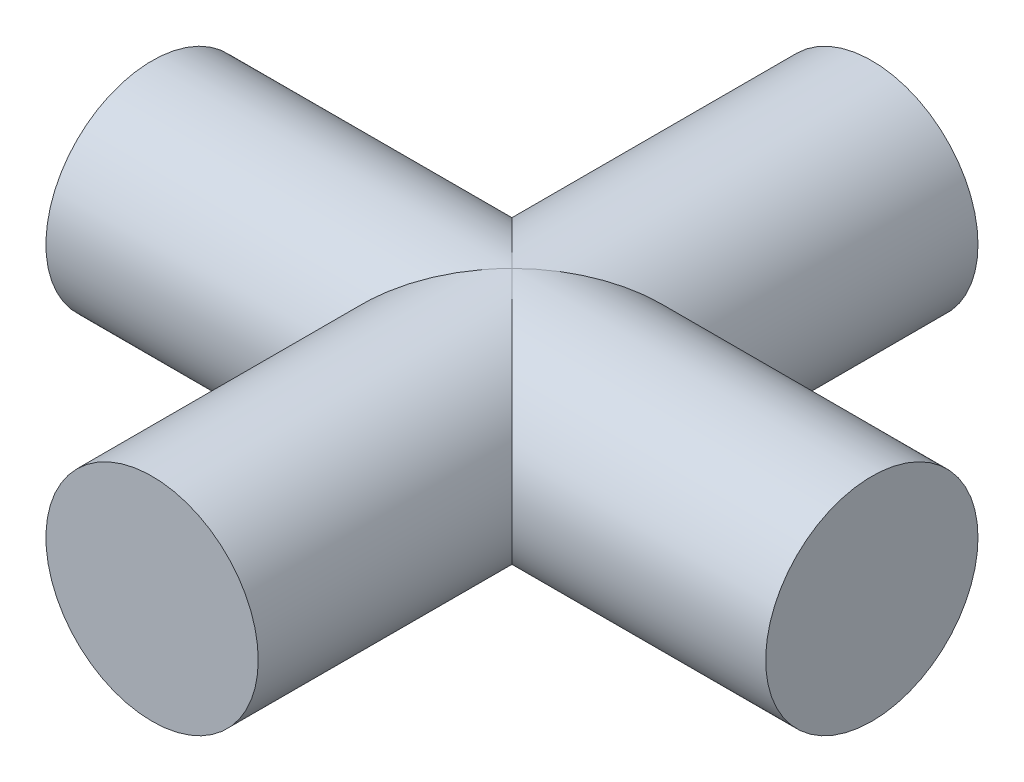
ISO-10303-21;
HEADER;
FILE_DESCRIPTION(('STEP AP214'),'2;1');
FILE_NAME('part.step','',(''),(''),'','','');
FILE_SCHEMA(('AUTOMOTIVE_DESIGN { 1 0 10303 214 1 1 1 1 }'));
ENDSEC;
DATA;
#1=APPLICATION_CONTEXT('core data for automotive mechanical design processes');
#2=APPLICATION_PROTOCOL_DEFINITION('international standard','automotive_design',2000,#1);
#3=PRODUCT_CONTEXT('',#1,'mechanical');
#4=PRODUCT('Part','Part','',(#3));
#5=PRODUCT_RELATED_PRODUCT_CATEGORY('part','',(#4));
#6=PRODUCT_DEFINITION_FORMATION('','',#4);
#7=PRODUCT_DEFINITION_CONTEXT('part definition',#1,'design');
#8=PRODUCT_DEFINITION('design','',#6,#7);
#9=PRODUCT_DEFINITION_SHAPE('','',#8);
#10=(LENGTH_UNIT() NAMED_UNIT(*) SI_UNIT(.MILLI.,.METRE.));
#11=(NAMED_UNIT(*) PLANE_ANGLE_UNIT() SI_UNIT($,.RADIAN.));
#12=(NAMED_UNIT(*) SI_UNIT($,.STERADIAN.) SOLID_ANGLE_UNIT());
#13=UNCERTAINTY_MEASURE_WITH_UNIT(LENGTH_MEASURE(1.E-05),#10,'distance_accuracy_value','');
#14=(GEOMETRIC_REPRESENTATION_CONTEXT(3) GLOBAL_UNCERTAINTY_ASSIGNED_CONTEXT((#13)) GLOBAL_UNIT_ASSIGNED_CONTEXT((#10,
#11,#12)) REPRESENTATION_CONTEXT('',''));
#15=CARTESIAN_POINT('',(0.,0.,0.));
#16=DIRECTION('',(0.,0.,1.));
#17=DIRECTION('',(1.,0.,0.));
#18=AXIS2_PLACEMENT_3D('',#15,#16,#17);
#19=CARTESIAN_POINT('',(0.,0.,5.));
#20=DIRECTION('',(0.,0.,-1.));
#21=DIRECTION('',(-1.,0.,0.));
#22=AXIS2_PLACEMENT_3D('',#19,#20,#21);
#23=CYLINDRICAL_SURFACE('',#22,1.475);
#24=CARTESIAN_POINT('',(0.,0.,5.));
#25=DIRECTION('',(0.,0.,1.));
#26=DIRECTION('',(1.,0.,0.));
#27=AXIS2_PLACEMENT_3D('',#24,#25,#26);
#28=CIRCLE('',#27,1.475);
#29=CARTESIAN_POINT('',(1.475,0.,5.));
#30=VERTEX_POINT('',#29);
#31=EDGE_CURVE('E70',#30,#30,#28,.T.);
#32=ORIENTED_EDGE('',*,*,#31,.F.);
#33=EDGE_LOOP('',(#32));
#34=FACE_BOUND('',#33,.T.);
#35=CARTESIAN_POINT('',(0.,0.,0.));
#36=DIRECTION('',(-0.707106781186547,0.,-0.707106781186547));
#37=DIRECTION('',(0.707106781186547,0.,-0.707106781186547));
#38=AXIS2_PLACEMENT_3D('',#35,#36,#37);
#39=ELLIPSE('',#38,2.08596500450032,1.475);
#40=CARTESIAN_POINT('',(0.,-1.475,0.));
#41=VERTEX_POINT('',#40);
#42=CARTESIAN_POINT('',(0.,1.475,0.));
#43=VERTEX_POINT('',#42);
#44=EDGE_CURVE('E52',#41,#43,#39,.T.);
#45=ORIENTED_EDGE('',*,*,#44,.F.);
#46=CARTESIAN_POINT('',(0.,0.,0.));
#47=DIRECTION('',(0.707106781186547,0.,-0.707106781186547));
#48=DIRECTION('',(-0.707106781186547,0.,-0.707106781186547));
#49=AXIS2_PLACEMENT_3D('',#46,#47,#48);
#50=ELLIPSE('',#49,2.08596500450032,1.475);
#51=EDGE_CURVE('E64',#43,#41,#50,.T.);
#52=ORIENTED_EDGE('',*,*,#51,.F.);
#53=EDGE_LOOP('',(#45,#52));
#54=FACE_BOUND('',#53,.T.);
#55=ADVANCED_FACE('F43',(#34,#54),#23,.T.);
#56=CARTESIAN_POINT('',(0.,0.,5.));
#57=DIRECTION('',(0.,0.,1.));
#58=DIRECTION('',(1.,0.,0.));
#59=AXIS2_PLACEMENT_3D('',#56,#57,#58);
#60=PLANE('',#59);
#61=ORIENTED_EDGE('',*,*,#31,.T.);
#62=EDGE_LOOP('',(#61));
#63=FACE_BOUND('',#62,.T.);
#64=ADVANCED_FACE('F94',(#63),#60,.T.);
#65=CARTESIAN_POINT('',(-5.,0.,0.));
#66=DIRECTION('',(1.,0.,0.));
#67=DIRECTION('',(0.,0.,-1.));
#68=AXIS2_PLACEMENT_3D('',#65,#66,#67);
#69=PLANE('',#68);
#70=CARTESIAN_POINT('',(-5.,0.,0.));
#71=DIRECTION('',(1.,0.,0.));
#72=DIRECTION('',(0.,0.,-1.));
#73=AXIS2_PLACEMENT_3D('',#70,#71,#72);
#74=CIRCLE('',#73,1.475);
#75=CARTESIAN_POINT('',(-5.,0.,-1.475));
#76=VERTEX_POINT('',#75);
#77=EDGE_CURVE('E111',#76,#76,#74,.T.);
#78=ORIENTED_EDGE('',*,*,#77,.F.);
#79=EDGE_LOOP('',(#78));
#80=FACE_BOUND('',#79,.T.);
#81=ADVANCED_FACE('F91',(#80),#69,.F.);
#82=CARTESIAN_POINT('',(5.,0.,0.));
#83=DIRECTION('',(-1.,0.,0.));
#84=DIRECTION('',(0.,0.,1.));
#85=AXIS2_PLACEMENT_3D('',#82,#83,#84);
#86=CYLINDRICAL_SURFACE('',#85,1.475);
#87=ORIENTED_EDGE('',*,*,#77,.T.);
#88=EDGE_LOOP('',(#87));
#89=FACE_BOUND('',#88,.T.);
#90=CARTESIAN_POINT('',(0.,0.,0.));
#91=DIRECTION('',(0.707106781186547,0.,-0.707106781186547));
#92=DIRECTION('',(-0.707106781186547,0.,-0.707106781186547));
#93=AXIS2_PLACEMENT_3D('',#90,#91,#92);
#94=ELLIPSE('',#93,2.08596500450032,1.475);
#95=EDGE_CURVE('E58',#43,#41,#94,.F.);
#96=ORIENTED_EDGE('',*,*,#95,.T.);
#97=ORIENTED_EDGE('',*,*,#44,.T.);
#98=EDGE_LOOP('',(#96,#97));
#99=FACE_BOUND('',#98,.T.);
#100=ADVANCED_FACE('F72',(#89,#99),#86,.T.);
#101=CARTESIAN_POINT('',(0.,0.,-5.));
#102=DIRECTION('',(0.,0.,1.));
#103=DIRECTION('',(1.,0.,0.));
#104=AXIS2_PLACEMENT_3D('',#101,#102,#103);
#105=PLANE('',#104);
#106=CARTESIAN_POINT('',(0.,0.,-5.));
#107=DIRECTION('',(0.,0.,1.));
#108=DIRECTION('',(1.,0.,0.));
#109=AXIS2_PLACEMENT_3D('',#106,#107,#108);
#110=CIRCLE('',#109,1.475);
#111=CARTESIAN_POINT('',(1.475,0.,-5.));
#112=VERTEX_POINT('',#111);
#113=EDGE_CURVE('E103',#112,#112,#110,.T.);
#114=ORIENTED_EDGE('',*,*,#113,.F.);
#115=EDGE_LOOP('',(#114));
#116=FACE_BOUND('',#115,.T.);
#117=ADVANCED_FACE('F85',(#116),#105,.F.);
#118=ORIENTED_EDGE('',*,*,#113,.T.);
#119=EDGE_LOOP('',(#118));
#120=FACE_BOUND('',#119,.T.);
#121=CARTESIAN_POINT('',(0.,0.,0.));
#122=DIRECTION('',(-0.707106781186547,0.,-0.707106781186547));
#123=DIRECTION('',(0.707106781186547,0.,-0.707106781186547));
#124=AXIS2_PLACEMENT_3D('',#121,#122,#123);
#125=ELLIPSE('',#124,2.08596500450032,1.475);
#126=EDGE_CURVE('E11',#41,#43,#125,.F.);
#127=ORIENTED_EDGE('',*,*,#126,.F.);
#128=ORIENTED_EDGE('',*,*,#95,.F.);
#129=EDGE_LOOP('',(#127,#128));
#130=FACE_BOUND('',#129,.T.);
#131=ADVANCED_FACE('F45',(#120,#130),#23,.T.);
#132=CARTESIAN_POINT('',(5.,0.,0.));
#133=DIRECTION('',(1.,0.,0.));
#134=DIRECTION('',(0.,0.,-1.));
#135=AXIS2_PLACEMENT_3D('',#132,#133,#134);
#136=CIRCLE('',#135,1.475);
#137=CARTESIAN_POINT('',(5.,0.,-1.475));
#138=VERTEX_POINT('',#137);
#139=EDGE_CURVE('E108',#138,#138,#136,.T.);
#140=ORIENTED_EDGE('',*,*,#139,.F.);
#141=EDGE_LOOP('',(#140));
#142=FACE_BOUND('',#141,.T.);
#143=ORIENTED_EDGE('',*,*,#51,.T.);
#144=ORIENTED_EDGE('',*,*,#126,.T.);
#145=EDGE_LOOP('',(#143,#144));
#146=FACE_BOUND('',#145,.T.);
#147=ADVANCED_FACE('F74',(#142,#146),#86,.T.);
#148=CARTESIAN_POINT('',(5.,0.,0.));
#149=DIRECTION('',(1.,0.,0.));
#150=DIRECTION('',(0.,0.,-1.));
#151=AXIS2_PLACEMENT_3D('',#148,#149,#150);
#152=PLANE('',#151);
#153=ORIENTED_EDGE('',*,*,#139,.T.);
#154=EDGE_LOOP('',(#153));
#155=FACE_BOUND('',#154,.T.);
#156=ADVANCED_FACE('F76',(#155),#152,.T.);
#157=CLOSED_SHELL('',(#55,#64,#81,#100,#117,#131,#147,#156));
#158=MANIFOLD_SOLID_BREP('B2',#157);
#159=ADVANCED_BREP_SHAPE_REPRESENTATION('',(#18,#158),#14);
#160=SHAPE_DEFINITION_REPRESENTATION(#9,#159);
ENDSEC;
END-ISO-10303-21;
